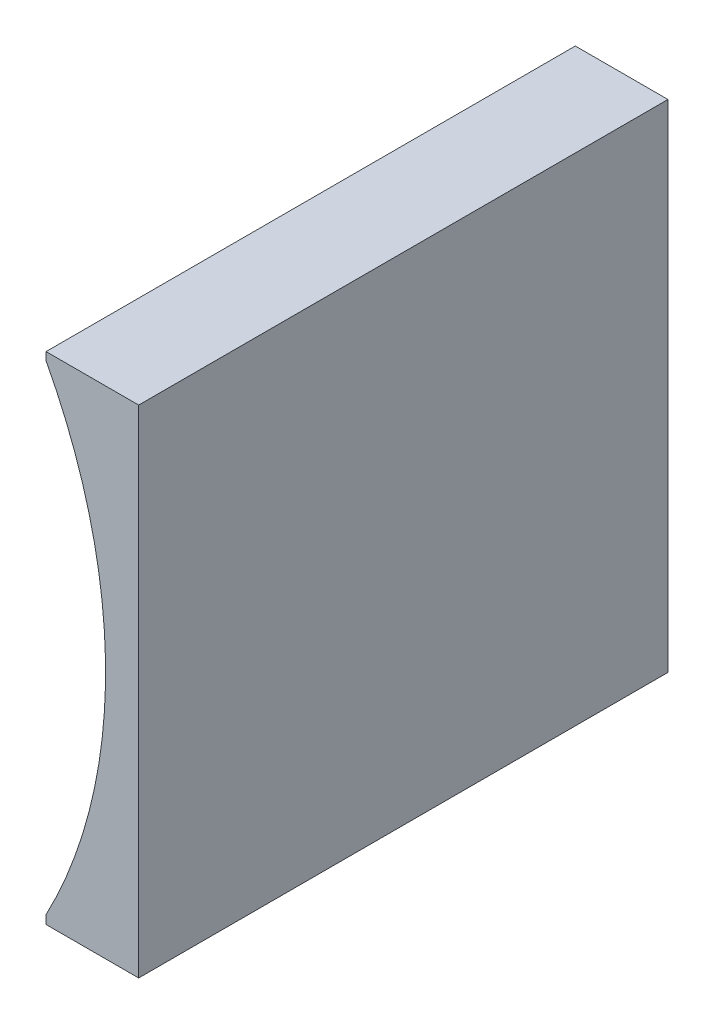
ISO-10303-21;
HEADER;
FILE_DESCRIPTION(('STEP AP214'),'2;1');
FILE_NAME('part.step','',(''),(''),'','','');
FILE_SCHEMA(('AUTOMOTIVE_DESIGN { 1 0 10303 214 1 1 1 1 }'));
ENDSEC;
DATA;
#1=APPLICATION_CONTEXT('core data for automotive mechanical design processes');
#2=APPLICATION_PROTOCOL_DEFINITION('international standard','automotive_design',2000,#1);
#3=PRODUCT_CONTEXT('',#1,'mechanical');
#4=PRODUCT('Part','Part','',(#3));
#5=PRODUCT_RELATED_PRODUCT_CATEGORY('part','',(#4));
#6=PRODUCT_DEFINITION_FORMATION('','',#4);
#7=PRODUCT_DEFINITION_CONTEXT('part definition',#1,'design');
#8=PRODUCT_DEFINITION('design','',#6,#7);
#9=PRODUCT_DEFINITION_SHAPE('','',#8);
#10=(LENGTH_UNIT() NAMED_UNIT(*) SI_UNIT(.MILLI.,.METRE.));
#11=(NAMED_UNIT(*) PLANE_ANGLE_UNIT() SI_UNIT($,.RADIAN.));
#12=(NAMED_UNIT(*) SI_UNIT($,.STERADIAN.) SOLID_ANGLE_UNIT());
#13=UNCERTAINTY_MEASURE_WITH_UNIT(LENGTH_MEASURE(1.E-05),#10,'distance_accuracy_value','');
#14=(GEOMETRIC_REPRESENTATION_CONTEXT(3) GLOBAL_UNCERTAINTY_ASSIGNED_CONTEXT((#13)) GLOBAL_UNIT_ASSIGNED_CONTEXT((#10,
#11,#12)) REPRESENTATION_CONTEXT('',''));
#15=CARTESIAN_POINT('',(0.,0.,0.));
#16=DIRECTION('',(0.,0.,1.));
#17=DIRECTION('',(1.,0.,0.));
#18=AXIS2_PLACEMENT_3D('',#15,#16,#17);
#19=CARTESIAN_POINT('',(21.2416650758097,28.0054414010397,-1.57725543159495));
#20=DIRECTION('',(1.,0.,0.));
#21=DIRECTION('',(0.,0.,-1.));
#22=AXIS2_PLACEMENT_3D('',#19,#20,#21);
#23=PLANE('',#22);
#24=DIRECTION('',(0.,-1.,0.));
#25=VECTOR('',#24,1.);
#26=CARTESIAN_POINT('',(21.2416650758097,28.0054414010397,-33.5772554315949));
#27=LINE('',#26,#25);
#28=CARTESIAN_POINT('',(21.2416650758097,28.0054414010397,-33.5772554315949));
#29=VERTEX_POINT('',#28);
#30=CARTESIAN_POINT('',(21.2416650758097,27.5253098210397,-33.5772554315949));
#31=VERTEX_POINT('',#30);
#32=EDGE_CURVE('E71',#29,#31,#27,.T.);
#33=ORIENTED_EDGE('',*,*,#32,.T.);
#34=DIRECTION('',(0.,0.,-1.));
#35=VECTOR('',#34,1.);
#36=CARTESIAN_POINT('',(21.2416650758097,27.5253098210397,-1.57725543159495));
#37=LINE('',#36,#35);
#38=CARTESIAN_POINT('',(21.2416650758097,27.5253098210397,-1.57725543159495));
#39=VERTEX_POINT('',#38);
#40=EDGE_CURVE('E9',#39,#31,#37,.T.);
#41=ORIENTED_EDGE('',*,*,#40,.F.);
#42=DIRECTION('',(0.,-1.,0.));
#43=VECTOR('',#42,1.);
#44=CARTESIAN_POINT('',(21.2416650758097,28.0054414010397,-1.57725543159495));
#45=LINE('',#44,#43);
#46=CARTESIAN_POINT('',(21.2416650758097,28.0054414010397,-1.57725543159495));
#47=VERTEX_POINT('',#46);
#48=EDGE_CURVE('E94',#47,#39,#45,.T.);
#49=ORIENTED_EDGE('',*,*,#48,.F.);
#50=DIRECTION('',(0.,0.,-1.));
#51=VECTOR('',#50,1.);
#52=CARTESIAN_POINT('',(21.2416650758097,28.0054414010397,-1.57725543159495));
#53=LINE('',#52,#51);
#54=EDGE_CURVE('E84',#47,#29,#53,.T.);
#55=ORIENTED_EDGE('',*,*,#54,.T.);
#56=EDGE_LOOP('',(#33,#41,#49,#55));
#57=FACE_BOUND('',#56,.T.);
#58=ADVANCED_FACE('F15',(#57),#23,.F.);
#59=CARTESIAN_POINT('',(-6.15833492419033,13.0256546527262,-1.57725543159495));
#60=DIRECTION('',(0.,0.,-1.));
#61=DIRECTION('',(-1.,0.,0.));
#62=AXIS2_PLACEMENT_3D('',#59,#60,#61);
#63=CYLINDRICAL_SURFACE('',#62,31.);
#64=CARTESIAN_POINT('',(-6.15833492419033,13.0256546527262,-33.5772554315949));
#65=DIRECTION('',(0.,0.,-1.));
#66=DIRECTION('',(-1.,0.,0.));
#67=AXIS2_PLACEMENT_3D('',#64,#65,#66);
#68=CIRCLE('',#67,31.);
#69=CARTESIAN_POINT('',(21.2416650758097,-1.47400051558731,-33.5772554315949));
#70=VERTEX_POINT('',#69);
#71=EDGE_CURVE('E67',#31,#70,#68,.T.);
#72=ORIENTED_EDGE('',*,*,#71,.T.);
#73=DIRECTION('',(0.,0.,-1.));
#74=VECTOR('',#73,1.);
#75=CARTESIAN_POINT('',(21.2416650758097,-1.47400051558731,-1.57725543159495));
#76=LINE('',#75,#74);
#77=CARTESIAN_POINT('',(21.2416650758097,-1.47400051558731,-1.57725543159495));
#78=VERTEX_POINT('',#77);
#79=EDGE_CURVE('E22',#78,#70,#76,.T.);
#80=ORIENTED_EDGE('',*,*,#79,.F.);
#81=CARTESIAN_POINT('',(-6.15833492419033,13.0256546527262,-1.57725543159495));
#82=DIRECTION('',(0.,0.,-1.));
#83=DIRECTION('',(-1.,0.,0.));
#84=AXIS2_PLACEMENT_3D('',#81,#82,#83);
#85=CIRCLE('',#84,31.);
#86=EDGE_CURVE('E80',#39,#78,#85,.T.);
#87=ORIENTED_EDGE('',*,*,#86,.F.);
#88=ORIENTED_EDGE('',*,*,#40,.T.);
#89=EDGE_LOOP('',(#72,#80,#87,#88));
#90=FACE_BOUND('',#89,.T.);
#91=ADVANCED_FACE('F79',(#90),#63,.F.);
#92=CARTESIAN_POINT('',(21.2416650758097,-1.99455859896033,-1.57725543159495));
#93=DIRECTION('',(1.,0.,0.));
#94=DIRECTION('',(0.,0.,-1.));
#95=AXIS2_PLACEMENT_3D('',#92,#93,#94);
#96=PLANE('',#95);
#97=DIRECTION('',(0.,-1.,0.));
#98=VECTOR('',#97,1.);
#99=CARTESIAN_POINT('',(21.2416650758097,-1.99455859896033,-33.5772554315949));
#100=LINE('',#99,#98);
#101=CARTESIAN_POINT('',(21.2416650758097,-1.99455859896033,-33.5772554315949));
#102=VERTEX_POINT('',#101);
#103=EDGE_CURVE('E73',#70,#102,#100,.T.);
#104=ORIENTED_EDGE('',*,*,#103,.T.);
#105=DIRECTION('',(0.,0.,-1.));
#106=VECTOR('',#105,1.);
#107=CARTESIAN_POINT('',(21.2416650758097,-1.99455859896033,-1.57725543159495));
#108=LINE('',#107,#106);
#109=CARTESIAN_POINT('',(21.2416650758097,-1.99455859896033,-1.57725543159495));
#110=VERTEX_POINT('',#109);
#111=EDGE_CURVE('E110',#110,#102,#108,.T.);
#112=ORIENTED_EDGE('',*,*,#111,.F.);
#113=DIRECTION('',(0.,-1.,0.));
#114=VECTOR('',#113,1.);
#115=CARTESIAN_POINT('',(21.2416650758097,-1.99455859896033,-1.57725543159495));
#116=LINE('',#115,#114);
#117=EDGE_CURVE('E97',#78,#110,#116,.T.);
#118=ORIENTED_EDGE('',*,*,#117,.F.);
#119=ORIENTED_EDGE('',*,*,#79,.T.);
#120=EDGE_LOOP('',(#104,#112,#118,#119));
#121=FACE_BOUND('',#120,.T.);
#122=ADVANCED_FACE('F114',(#121),#96,.F.);
#123=CARTESIAN_POINT('',(21.2416650758097,-1.99455859896033,-1.57725543159495));
#124=DIRECTION('',(0.,1.,0.));
#125=DIRECTION('',(-1.,0.,0.));
#126=AXIS2_PLACEMENT_3D('',#123,#124,#125);
#127=PLANE('',#126);
#128=DIRECTION('',(1.,0.,0.));
#129=VECTOR('',#128,1.);
#130=CARTESIAN_POINT('',(21.2416650758097,-1.99455859896033,-33.5772554315949));
#131=LINE('',#130,#129);
#132=CARTESIAN_POINT('',(26.8416650758097,-1.99455859896033,-33.5772554315949));
#133=VERTEX_POINT('',#132);
#134=EDGE_CURVE('E88',#102,#133,#131,.T.);
#135=ORIENTED_EDGE('',*,*,#134,.T.);
#136=DIRECTION('',(0.,0.,-1.));
#137=VECTOR('',#136,1.);
#138=CARTESIAN_POINT('',(26.8416650758097,-1.99455859896033,-1.57725543159495));
#139=LINE('',#138,#137);
#140=CARTESIAN_POINT('',(26.8416650758097,-1.99455859896033,-1.57725543159495));
#141=VERTEX_POINT('',#140);
#142=EDGE_CURVE('E107',#141,#133,#139,.T.);
#143=ORIENTED_EDGE('',*,*,#142,.F.);
#144=DIRECTION('',(1.,0.,0.));
#145=VECTOR('',#144,1.);
#146=CARTESIAN_POINT('',(21.2416650758097,-1.99455859896033,-1.57725543159495));
#147=LINE('',#146,#145);
#148=EDGE_CURVE('E99',#110,#141,#147,.T.);
#149=ORIENTED_EDGE('',*,*,#148,.F.);
#150=ORIENTED_EDGE('',*,*,#111,.T.);
#151=EDGE_LOOP('',(#135,#143,#149,#150));
#152=FACE_BOUND('',#151,.T.);
#153=ADVANCED_FACE('F120',(#152),#127,.F.);
#154=CARTESIAN_POINT('',(26.8416650758097,-1.99455859896033,-1.57725543159495));
#155=DIRECTION('',(-1.,0.,0.));
#156=DIRECTION('',(0.,0.,1.));
#157=AXIS2_PLACEMENT_3D('',#154,#155,#156);
#158=PLANE('',#157);
#159=DIRECTION('',(0.,1.,0.));
#160=VECTOR('',#159,1.);
#161=CARTESIAN_POINT('',(26.8416650758097,-1.99455859896033,-33.5772554315949));
#162=LINE('',#161,#160);
#163=CARTESIAN_POINT('',(26.8416650758097,28.0054414010397,-33.5772554315949));
#164=VERTEX_POINT('',#163);
#165=EDGE_CURVE('E90',#133,#164,#162,.T.);
#166=ORIENTED_EDGE('',*,*,#165,.T.);
#167=DIRECTION('',(0.,0.,-1.));
#168=VECTOR('',#167,1.);
#169=CARTESIAN_POINT('',(26.8416650758097,28.0054414010397,-1.57725543159495));
#170=LINE('',#169,#168);
#171=CARTESIAN_POINT('',(26.8416650758097,28.0054414010397,-1.57725543159495));
#172=VERTEX_POINT('',#171);
#173=EDGE_CURVE('E104',#172,#164,#170,.T.);
#174=ORIENTED_EDGE('',*,*,#173,.F.);
#175=DIRECTION('',(0.,1.,0.));
#176=VECTOR('',#175,1.);
#177=CARTESIAN_POINT('',(26.8416650758097,-1.99455859896033,-1.57725543159495));
#178=LINE('',#177,#176);
#179=EDGE_CURVE('E34',#141,#172,#178,.T.);
#180=ORIENTED_EDGE('',*,*,#179,.F.);
#181=ORIENTED_EDGE('',*,*,#142,.T.);
#182=EDGE_LOOP('',(#166,#174,#180,#181));
#183=FACE_BOUND('',#182,.T.);
#184=ADVANCED_FACE('F123',(#183),#158,.F.);
#185=CARTESIAN_POINT('',(26.8416650758097,28.0054414010397,-1.57725543159495));
#186=DIRECTION('',(0.,-1.,0.));
#187=DIRECTION('',(1.,0.,0.));
#188=AXIS2_PLACEMENT_3D('',#185,#186,#187);
#189=PLANE('',#188);
#190=DIRECTION('',(-1.,0.,0.));
#191=VECTOR('',#190,1.);
#192=CARTESIAN_POINT('',(26.8416650758097,28.0054414010397,-33.5772554315949));
#193=LINE('',#192,#191);
#194=EDGE_CURVE('E92',#164,#29,#193,.T.);
#195=ORIENTED_EDGE('',*,*,#194,.T.);
#196=ORIENTED_EDGE('',*,*,#54,.F.);
#197=DIRECTION('',(-1.,0.,0.));
#198=VECTOR('',#197,1.);
#199=CARTESIAN_POINT('',(26.8416650758097,28.0054414010397,-1.57725543159495));
#200=LINE('',#199,#198);
#201=EDGE_CURVE('E29',#172,#47,#200,.T.);
#202=ORIENTED_EDGE('',*,*,#201,.F.);
#203=ORIENTED_EDGE('',*,*,#173,.T.);
#204=EDGE_LOOP('',(#195,#196,#202,#203));
#205=FACE_BOUND('',#204,.T.);
#206=ADVANCED_FACE('F125',(#205),#189,.F.);
#207=CARTESIAN_POINT('',(-6.15833492419033,13.0256546527262,-1.57725543159495));
#208=DIRECTION('',(0.,0.,-1.));
#209=DIRECTION('',(-1.,0.,0.));
#210=AXIS2_PLACEMENT_3D('',#207,#208,#209);
#211=PLANE('',#210);
#212=ORIENTED_EDGE('',*,*,#48,.T.);
#213=ORIENTED_EDGE('',*,*,#86,.T.);
#214=ORIENTED_EDGE('',*,*,#117,.T.);
#215=ORIENTED_EDGE('',*,*,#148,.T.);
#216=ORIENTED_EDGE('',*,*,#179,.T.);
#217=ORIENTED_EDGE('',*,*,#201,.T.);
#218=EDGE_LOOP('',(#212,#213,#214,#215,#216,#217));
#219=FACE_BOUND('',#218,.T.);
#220=ADVANCED_FACE('F117',(#219),#211,.F.);
#221=CARTESIAN_POINT('',(-6.15833492419033,13.0256546527262,-33.5772554315949));
#222=DIRECTION('',(0.,0.,-1.));
#223=DIRECTION('',(-1.,0.,0.));
#224=AXIS2_PLACEMENT_3D('',#221,#222,#223);
#225=PLANE('',#224);
#226=ORIENTED_EDGE('',*,*,#32,.F.);
#227=ORIENTED_EDGE('',*,*,#194,.F.);
#228=ORIENTED_EDGE('',*,*,#165,.F.);
#229=ORIENTED_EDGE('',*,*,#134,.F.);
#230=ORIENTED_EDGE('',*,*,#103,.F.);
#231=ORIENTED_EDGE('',*,*,#71,.F.);
#232=EDGE_LOOP('',(#226,#227,#228,#229,#230,#231));
#233=FACE_BOUND('',#232,.T.);
#234=ADVANCED_FACE('F68',(#233),#225,.T.);
#235=CLOSED_SHELL('',(#58,#91,#122,#153,#184,#206,#220,#234));
#236=MANIFOLD_SOLID_BREP('B1',#235);
#237=ADVANCED_BREP_SHAPE_REPRESENTATION('',(#18,#236),#14);
#238=SHAPE_DEFINITION_REPRESENTATION(#9,#237);
ENDSEC;
END-ISO-10303-21;
